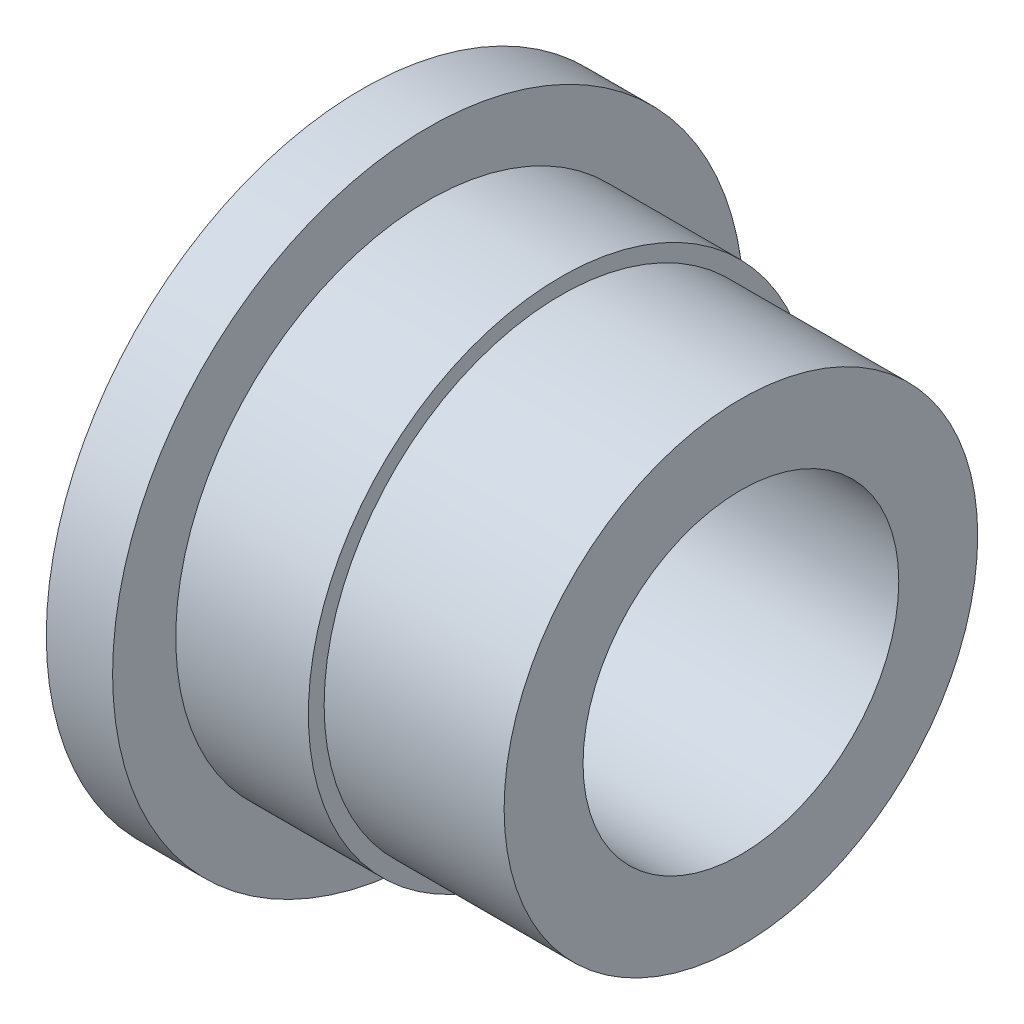
ISO-10303-21;
HEADER;
FILE_DESCRIPTION(('STEP AP214'),'2;1');
FILE_NAME('part.step','',(''),(''),'','','');
FILE_SCHEMA(('AUTOMOTIVE_DESIGN { 1 0 10303 214 1 1 1 1 }'));
ENDSEC;
DATA;
#1=APPLICATION_CONTEXT('core data for automotive mechanical design processes');
#2=APPLICATION_PROTOCOL_DEFINITION('international standard','automotive_design',2000,#1);
#3=PRODUCT_CONTEXT('',#1,'mechanical');
#4=PRODUCT('Part','Part','',(#3));
#5=PRODUCT_RELATED_PRODUCT_CATEGORY('part','',(#4));
#6=PRODUCT_DEFINITION_FORMATION('','',#4);
#7=PRODUCT_DEFINITION_CONTEXT('part definition',#1,'design');
#8=PRODUCT_DEFINITION('design','',#6,#7);
#9=PRODUCT_DEFINITION_SHAPE('','',#8);
#10=(LENGTH_UNIT() NAMED_UNIT(*) SI_UNIT(.MILLI.,.METRE.));
#11=(NAMED_UNIT(*) PLANE_ANGLE_UNIT() SI_UNIT($,.RADIAN.));
#12=(NAMED_UNIT(*) SI_UNIT($,.STERADIAN.) SOLID_ANGLE_UNIT());
#13=UNCERTAINTY_MEASURE_WITH_UNIT(LENGTH_MEASURE(1.E-05),#10,'distance_accuracy_value','');
#14=(GEOMETRIC_REPRESENTATION_CONTEXT(3) GLOBAL_UNCERTAINTY_ASSIGNED_CONTEXT((#13)) GLOBAL_UNIT_ASSIGNED_CONTEXT((#10,
#11,#12)) REPRESENTATION_CONTEXT('',''));
#15=CARTESIAN_POINT('',(0.,0.,0.));
#16=DIRECTION('',(0.,0.,1.));
#17=DIRECTION('',(1.,0.,0.));
#18=AXIS2_PLACEMENT_3D('',#15,#16,#17);
#19=CARTESIAN_POINT('',(0.,0.,0.));
#20=DIRECTION('',(1.,0.,0.));
#21=DIRECTION('',(0.,0.,-1.));
#22=AXIS2_PLACEMENT_3D('',#19,#20,#21);
#23=CYLINDRICAL_SURFACE('',#22,5.);
#24=CARTESIAN_POINT('',(0.,0.,0.));
#25=DIRECTION('',(1.,0.,0.));
#26=DIRECTION('',(0.,0.,-1.));
#27=AXIS2_PLACEMENT_3D('',#24,#25,#26);
#28=CIRCLE('',#27,5.);
#29=CARTESIAN_POINT('',(0.,0.,-5.));
#30=VERTEX_POINT('',#29);
#31=EDGE_CURVE('E10',#30,#30,#28,.T.);
#32=ORIENTED_EDGE('',*,*,#31,.T.);
#33=EDGE_LOOP('',(#32));
#34=FACE_BOUND('',#33,.T.);
#35=CARTESIAN_POINT('',(-12.,0.,0.));
#36=DIRECTION('',(1.,0.,0.));
#37=DIRECTION('',(0.,0.,-1.));
#38=AXIS2_PLACEMENT_3D('',#35,#36,#37);
#39=CIRCLE('',#38,5.00000000000001);
#40=CARTESIAN_POINT('',(-12.,0.,-5.00000000000001));
#41=VERTEX_POINT('',#40);
#42=EDGE_CURVE('E50',#41,#41,#39,.T.);
#43=ORIENTED_EDGE('',*,*,#42,.F.);
#44=EDGE_LOOP('',(#43));
#45=FACE_BOUND('',#44,.T.);
#46=ADVANCED_FACE('F22',(#34,#45),#23,.F.);
#47=CARTESIAN_POINT('',(0.,5.,0.));
#48=DIRECTION('',(1.,0.,0.));
#49=DIRECTION('',(0.,0.,-1.));
#50=AXIS2_PLACEMENT_3D('',#47,#48,#49);
#51=PLANE('',#50);
#52=CARTESIAN_POINT('',(0.,0.,0.));
#53=DIRECTION('',(1.,0.,0.));
#54=DIRECTION('',(0.,0.,-1.));
#55=AXIS2_PLACEMENT_3D('',#52,#53,#54);
#56=CIRCLE('',#55,7.5);
#57=CARTESIAN_POINT('',(0.,0.,-7.5));
#58=VERTEX_POINT('',#57);
#59=EDGE_CURVE('E28',#58,#58,#56,.T.);
#60=ORIENTED_EDGE('',*,*,#59,.T.);
#61=EDGE_LOOP('',(#60));
#62=FACE_BOUND('',#61,.T.);
#63=ORIENTED_EDGE('',*,*,#31,.F.);
#64=EDGE_LOOP('',(#63));
#65=FACE_BOUND('',#64,.T.);
#66=ADVANCED_FACE('F58',(#62,#65),#51,.T.);
#67=CARTESIAN_POINT('',(0.,0.,0.));
#68=DIRECTION('',(1.,0.,0.));
#69=DIRECTION('',(0.,0.,-1.));
#70=AXIS2_PLACEMENT_3D('',#67,#68,#69);
#71=CYLINDRICAL_SURFACE('',#70,7.5);
#72=CARTESIAN_POINT('',(-5.7,0.,0.));
#73=DIRECTION('',(1.,0.,0.));
#74=DIRECTION('',(0.,0.,-1.));
#75=AXIS2_PLACEMENT_3D('',#72,#73,#74);
#76=CIRCLE('',#75,7.5);
#77=CARTESIAN_POINT('',(-5.7,0.,-7.5));
#78=VERTEX_POINT('',#77);
#79=EDGE_CURVE('E32',#78,#78,#76,.T.);
#80=ORIENTED_EDGE('',*,*,#79,.T.);
#81=EDGE_LOOP('',(#80));
#82=FACE_BOUND('',#81,.T.);
#83=ORIENTED_EDGE('',*,*,#59,.F.);
#84=EDGE_LOOP('',(#83));
#85=FACE_BOUND('',#84,.T.);
#86=ADVANCED_FACE('F62',(#82,#85),#71,.T.);
#87=CARTESIAN_POINT('',(-5.7,7.5,0.));
#88=DIRECTION('',(1.,0.,0.));
#89=DIRECTION('',(0.,0.,-1.));
#90=AXIS2_PLACEMENT_3D('',#87,#88,#89);
#91=PLANE('',#90);
#92=CARTESIAN_POINT('',(-5.7,0.,0.));
#93=DIRECTION('',(1.,0.,0.));
#94=DIRECTION('',(0.,0.,-1.));
#95=AXIS2_PLACEMENT_3D('',#92,#93,#94);
#96=CIRCLE('',#95,8.);
#97=CARTESIAN_POINT('',(-5.7,0.,-8.));
#98=VERTEX_POINT('',#97);
#99=EDGE_CURVE('E36',#98,#98,#96,.T.);
#100=ORIENTED_EDGE('',*,*,#99,.T.);
#101=EDGE_LOOP('',(#100));
#102=FACE_BOUND('',#101,.T.);
#103=ORIENTED_EDGE('',*,*,#79,.F.);
#104=EDGE_LOOP('',(#103));
#105=FACE_BOUND('',#104,.T.);
#106=ADVANCED_FACE('F66',(#102,#105),#91,.T.);
#107=CARTESIAN_POINT('',(0.,0.,0.));
#108=DIRECTION('',(1.,0.,0.));
#109=DIRECTION('',(0.,0.,-1.));
#110=AXIS2_PLACEMENT_3D('',#107,#108,#109);
#111=CYLINDRICAL_SURFACE('',#110,8.);
#112=CARTESIAN_POINT('',(-9.9,0.,0.));
#113=DIRECTION('',(1.,0.,0.));
#114=DIRECTION('',(0.,0.,-1.));
#115=AXIS2_PLACEMENT_3D('',#112,#113,#114);
#116=CIRCLE('',#115,8.);
#117=CARTESIAN_POINT('',(-9.9,0.,-8.));
#118=VERTEX_POINT('',#117);
#119=EDGE_CURVE('E41',#118,#118,#116,.T.);
#120=ORIENTED_EDGE('',*,*,#119,.T.);
#121=EDGE_LOOP('',(#120));
#122=FACE_BOUND('',#121,.T.);
#123=ORIENTED_EDGE('',*,*,#99,.F.);
#124=EDGE_LOOP('',(#123));
#125=FACE_BOUND('',#124,.T.);
#126=ADVANCED_FACE('F73',(#122,#125),#111,.T.);
#127=CARTESIAN_POINT('',(-9.9,8.,0.));
#128=DIRECTION('',(1.,0.,0.));
#129=DIRECTION('',(0.,0.,-1.));
#130=AXIS2_PLACEMENT_3D('',#127,#128,#129);
#131=PLANE('',#130);
#132=CARTESIAN_POINT('',(-9.9,0.,0.));
#133=DIRECTION('',(1.,0.,0.));
#134=DIRECTION('',(0.,0.,-1.));
#135=AXIS2_PLACEMENT_3D('',#132,#133,#134);
#136=CIRCLE('',#135,10.);
#137=CARTESIAN_POINT('',(-9.9,0.,-10.));
#138=VERTEX_POINT('',#137);
#139=EDGE_CURVE('E44',#138,#138,#136,.T.);
#140=ORIENTED_EDGE('',*,*,#139,.T.);
#141=EDGE_LOOP('',(#140));
#142=FACE_BOUND('',#141,.T.);
#143=ORIENTED_EDGE('',*,*,#119,.F.);
#144=EDGE_LOOP('',(#143));
#145=FACE_BOUND('',#144,.T.);
#146=ADVANCED_FACE('F77',(#142,#145),#131,.T.);
#147=CARTESIAN_POINT('',(0.,0.,0.));
#148=DIRECTION('',(1.,0.,0.));
#149=DIRECTION('',(0.,0.,-1.));
#150=AXIS2_PLACEMENT_3D('',#147,#148,#149);
#151=CYLINDRICAL_SURFACE('',#150,10.);
#152=CARTESIAN_POINT('',(-12.,0.,0.));
#153=DIRECTION('',(1.,0.,0.));
#154=DIRECTION('',(0.,0.,-1.));
#155=AXIS2_PLACEMENT_3D('',#152,#153,#154);
#156=CIRCLE('',#155,10.);
#157=CARTESIAN_POINT('',(-12.,0.,-10.));
#158=VERTEX_POINT('',#157);
#159=EDGE_CURVE('E47',#158,#158,#156,.T.);
#160=ORIENTED_EDGE('',*,*,#159,.T.);
#161=EDGE_LOOP('',(#160));
#162=FACE_BOUND('',#161,.T.);
#163=ORIENTED_EDGE('',*,*,#139,.F.);
#164=EDGE_LOOP('',(#163));
#165=FACE_BOUND('',#164,.T.);
#166=ADVANCED_FACE('F81',(#162,#165),#151,.T.);
#167=CARTESIAN_POINT('',(-12.,10.,0.));
#168=DIRECTION('',(-1.,0.,0.));
#169=DIRECTION('',(0.,0.,1.));
#170=AXIS2_PLACEMENT_3D('',#167,#168,#169);
#171=PLANE('',#170);
#172=ORIENTED_EDGE('',*,*,#42,.T.);
#173=EDGE_LOOP('',(#172));
#174=FACE_BOUND('',#173,.T.);
#175=ORIENTED_EDGE('',*,*,#159,.F.);
#176=EDGE_LOOP('',(#175));
#177=FACE_BOUND('',#176,.T.);
#178=ADVANCED_FACE('F54',(#174,#177),#171,.T.);
#179=CLOSED_SHELL('',(#46,#66,#86,#106,#126,#146,#166,#178));
#180=MANIFOLD_SOLID_BREP('B2',#179);
#181=ADVANCED_BREP_SHAPE_REPRESENTATION('',(#18,#180),#14);
#182=SHAPE_DEFINITION_REPRESENTATION(#9,#181);
ENDSEC;
END-ISO-10303-21;
